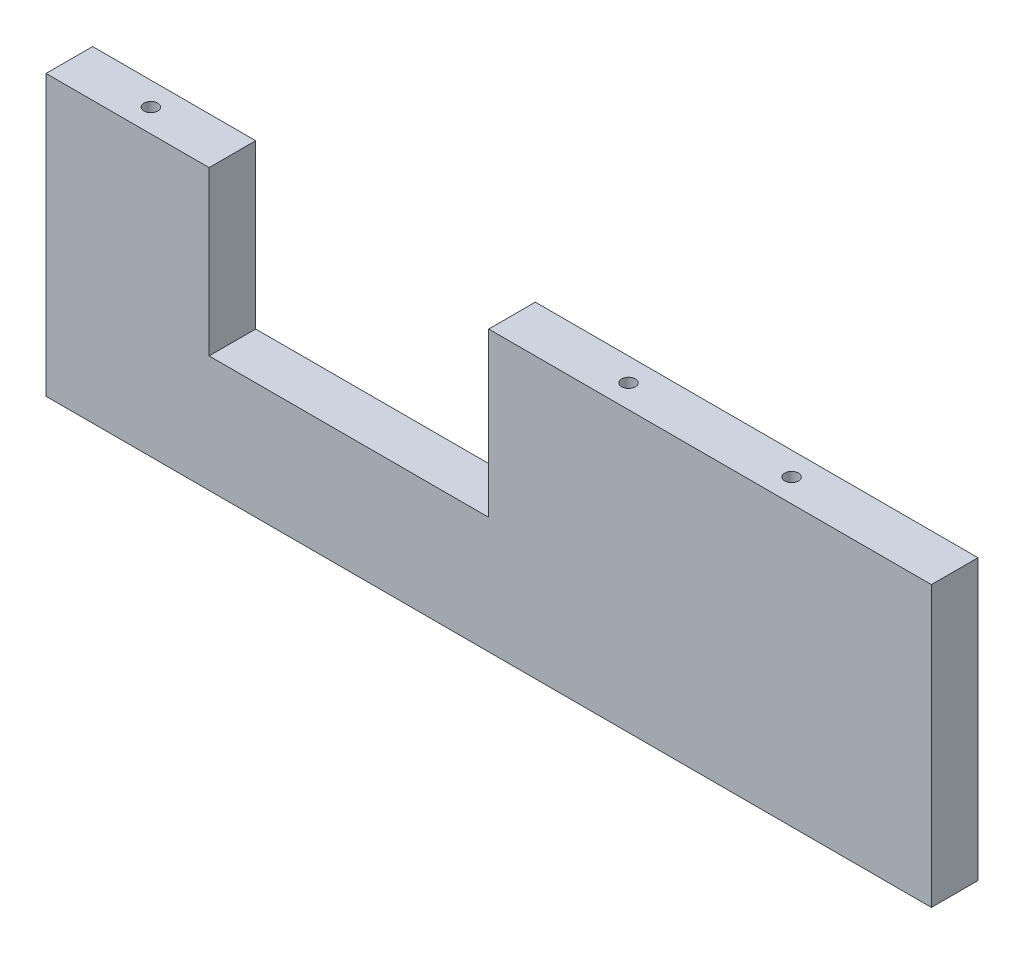
ISO-10303-21;
HEADER;
FILE_DESCRIPTION(('STEP AP214'),'2;1');
FILE_NAME('part.step','',(''),(''),'','','');
FILE_SCHEMA(('AUTOMOTIVE_DESIGN { 1 0 10303 214 1 1 1 1 }'));
ENDSEC;
DATA;
#1=APPLICATION_CONTEXT('core data for automotive mechanical design processes');
#2=APPLICATION_PROTOCOL_DEFINITION('international standard','automotive_design',2000,#1);
#3=PRODUCT_CONTEXT('',#1,'mechanical');
#4=PRODUCT('Part','Part','',(#3));
#5=PRODUCT_RELATED_PRODUCT_CATEGORY('part','',(#4));
#6=PRODUCT_DEFINITION_FORMATION('','',#4);
#7=PRODUCT_DEFINITION_CONTEXT('part definition',#1,'design');
#8=PRODUCT_DEFINITION('design','',#6,#7);
#9=PRODUCT_DEFINITION_SHAPE('','',#8);
#10=(LENGTH_UNIT() NAMED_UNIT(*) SI_UNIT(.MILLI.,.METRE.));
#11=(NAMED_UNIT(*) PLANE_ANGLE_UNIT() SI_UNIT($,.RADIAN.));
#12=(NAMED_UNIT(*) SI_UNIT($,.STERADIAN.) SOLID_ANGLE_UNIT());
#13=UNCERTAINTY_MEASURE_WITH_UNIT(LENGTH_MEASURE(1.E-05),#10,'distance_accuracy_value','');
#14=(GEOMETRIC_REPRESENTATION_CONTEXT(3) GLOBAL_UNCERTAINTY_ASSIGNED_CONTEXT((#13)) GLOBAL_UNIT_ASSIGNED_CONTEXT((#10,
#11,#12)) REPRESENTATION_CONTEXT('',''));
#15=CARTESIAN_POINT('',(0.,0.,0.));
#16=DIRECTION('',(0.,0.,1.));
#17=DIRECTION('',(1.,0.,0.));
#18=AXIS2_PLACEMENT_3D('',#15,#16,#17);
#19=CARTESIAN_POINT('',(0.,30.,10.));
#20=DIRECTION('',(0.,1.,0.));
#21=DIRECTION('',(0.,0.,1.));
#22=AXIS2_PLACEMENT_3D('',#19,#20,#21);
#23=PLANE('',#22);
#24=CARTESIAN_POINT('',(60.,30.,5.));
#25=DIRECTION('',(0.,1.,0.));
#26=DIRECTION('',(0.,0.,1.));
#27=AXIS2_PLACEMENT_3D('',#24,#25,#26);
#28=CIRCLE('',#27,1.47500000000001);
#29=CARTESIAN_POINT('',(60.,30.,6.475));
#30=VERTEX_POINT('',#29);
#31=EDGE_CURVE('E185',#30,#30,#28,.T.);
#32=ORIENTED_EDGE('',*,*,#31,.F.);
#33=EDGE_LOOP('',(#32));
#34=FACE_BOUND('',#33,.T.);
#35=CARTESIAN_POINT('',(25.,30.,5.));
#36=DIRECTION('',(0.,1.,0.));
#37=DIRECTION('',(0.,0.,1.));
#38=AXIS2_PLACEMENT_3D('',#35,#36,#37);
#39=CIRCLE('',#38,1.475);
#40=CARTESIAN_POINT('',(25.,30.,6.475));
#41=VERTEX_POINT('',#40);
#42=EDGE_CURVE('E179',#41,#41,#39,.T.);
#43=ORIENTED_EDGE('',*,*,#42,.F.);
#44=EDGE_LOOP('',(#43));
#45=FACE_BOUND('',#44,.T.);
#46=DIRECTION('',(1.,0.,0.));
#47=VECTOR('',#46,1.);
#48=CARTESIAN_POINT('',(0.,30.,0.));
#49=LINE('',#48,#47);
#50=CARTESIAN_POINT('',(0.,30.,0.));
#51=VERTEX_POINT('',#50);
#52=CARTESIAN_POINT('',(95.,30.,0.));
#53=VERTEX_POINT('',#52);
#54=EDGE_CURVE('E130',#51,#53,#49,.T.);
#55=ORIENTED_EDGE('',*,*,#54,.F.);
#56=DIRECTION('',(0.,0.,-1.));
#57=VECTOR('',#56,1.);
#58=CARTESIAN_POINT('',(0.,30.,10.));
#59=LINE('',#58,#57);
#60=CARTESIAN_POINT('',(0.,30.,10.));
#61=VERTEX_POINT('',#60);
#62=EDGE_CURVE('E11',#61,#51,#59,.T.);
#63=ORIENTED_EDGE('',*,*,#62,.F.);
#64=DIRECTION('',(1.,0.,0.));
#65=VECTOR('',#64,1.);
#66=CARTESIAN_POINT('',(0.,30.,10.));
#67=LINE('',#66,#65);
#68=CARTESIAN_POINT('',(95.,30.,10.));
#69=VERTEX_POINT('',#68);
#70=EDGE_CURVE('E149',#61,#69,#67,.T.);
#71=ORIENTED_EDGE('',*,*,#70,.T.);
#72=DIRECTION('',(0.,0.,-1.));
#73=VECTOR('',#72,1.);
#74=CARTESIAN_POINT('',(95.,30.,10.));
#75=LINE('',#74,#73);
#76=EDGE_CURVE('E52',#69,#53,#75,.T.);
#77=ORIENTED_EDGE('',*,*,#76,.T.);
#78=EDGE_LOOP('',(#55,#63,#71,#77));
#79=FACE_BOUND('',#78,.T.);
#80=ADVANCED_FACE('F35',(#34,#45,#79),#23,.T.);
#81=CARTESIAN_POINT('',(0.,0.,10.));
#82=DIRECTION('',(1.,0.,0.));
#83=DIRECTION('',(0.,1.,0.));
#84=AXIS2_PLACEMENT_3D('',#81,#82,#83);
#85=PLANE('',#84);
#86=DIRECTION('',(0.,-1.,0.));
#87=VECTOR('',#86,1.);
#88=CARTESIAN_POINT('',(0.,0.,0.));
#89=LINE('',#88,#87);
#90=CARTESIAN_POINT('',(0.,-4.99999999999999,0.));
#91=VERTEX_POINT('',#90);
#92=EDGE_CURVE('E132',#51,#91,#89,.T.);
#93=ORIENTED_EDGE('',*,*,#92,.T.);
#94=DIRECTION('',(0.,0.,-1.));
#95=VECTOR('',#94,1.);
#96=CARTESIAN_POINT('',(0.,-4.99999999999999,10.));
#97=LINE('',#96,#95);
#98=CARTESIAN_POINT('',(0.,-4.99999999999999,10.));
#99=VERTEX_POINT('',#98);
#100=EDGE_CURVE('E44',#99,#91,#97,.T.);
#101=ORIENTED_EDGE('',*,*,#100,.F.);
#102=DIRECTION('',(0.,-1.,0.));
#103=VECTOR('',#102,1.);
#104=CARTESIAN_POINT('',(0.,0.,10.));
#105=LINE('',#104,#103);
#106=EDGE_CURVE('E174',#61,#99,#105,.T.);
#107=ORIENTED_EDGE('',*,*,#106,.F.);
#108=ORIENTED_EDGE('',*,*,#62,.T.);
#109=EDGE_LOOP('',(#93,#101,#107,#108));
#110=FACE_BOUND('',#109,.T.);
#111=ADVANCED_FACE('F37',(#110),#85,.F.);
#112=CARTESIAN_POINT('',(0.,-4.99999999999999,10.));
#113=DIRECTION('',(0.,1.,0.));
#114=DIRECTION('',(0.,0.,1.));
#115=AXIS2_PLACEMENT_3D('',#112,#113,#114);
#116=PLANE('',#115);
#117=DIRECTION('',(1.,0.,0.));
#118=VECTOR('',#117,1.);
#119=CARTESIAN_POINT('',(0.,-4.99999999999999,0.));
#120=LINE('',#119,#118);
#121=CARTESIAN_POINT('',(-60.,-4.99999999999999,0.));
#122=VERTEX_POINT('',#121);
#123=EDGE_CURVE('E137',#122,#91,#120,.T.);
#124=ORIENTED_EDGE('',*,*,#123,.F.);
#125=DIRECTION('',(0.,0.,-1.));
#126=VECTOR('',#125,1.);
#127=CARTESIAN_POINT('',(-60.,-4.99999999999999,10.));
#128=LINE('',#127,#126);
#129=CARTESIAN_POINT('',(-60.,-4.99999999999999,10.));
#130=VERTEX_POINT('',#129);
#131=EDGE_CURVE('E155',#130,#122,#128,.T.);
#132=ORIENTED_EDGE('',*,*,#131,.F.);
#133=DIRECTION('',(1.,0.,0.));
#134=VECTOR('',#133,1.);
#135=CARTESIAN_POINT('',(0.,-4.99999999999999,10.));
#136=LINE('',#135,#134);
#137=EDGE_CURVE('E162',#130,#99,#136,.T.);
#138=ORIENTED_EDGE('',*,*,#137,.T.);
#139=ORIENTED_EDGE('',*,*,#100,.T.);
#140=EDGE_LOOP('',(#124,#132,#138,#139));
#141=FACE_BOUND('',#140,.T.);
#142=ADVANCED_FACE('F160',(#141),#116,.T.);
#143=CARTESIAN_POINT('',(-60.,0.,10.));
#144=DIRECTION('',(1.,0.,0.));
#145=DIRECTION('',(0.,1.,0.));
#146=AXIS2_PLACEMENT_3D('',#143,#144,#145);
#147=PLANE('',#146);
#148=DIRECTION('',(0.,-1.,0.));
#149=VECTOR('',#148,1.);
#150=CARTESIAN_POINT('',(-60.,0.,0.));
#151=LINE('',#150,#149);
#152=CARTESIAN_POINT('',(-60.,30.,0.));
#153=VERTEX_POINT('',#152);
#154=EDGE_CURVE('E140',#153,#122,#151,.T.);
#155=ORIENTED_EDGE('',*,*,#154,.F.);
#156=DIRECTION('',(0.,0.,-1.));
#157=VECTOR('',#156,1.);
#158=CARTESIAN_POINT('',(-60.,30.,10.));
#159=LINE('',#158,#157);
#160=CARTESIAN_POINT('',(-60.,30.,10.));
#161=VERTEX_POINT('',#160);
#162=EDGE_CURVE('E153',#161,#153,#159,.T.);
#163=ORIENTED_EDGE('',*,*,#162,.F.);
#164=DIRECTION('',(0.,-1.,0.));
#165=VECTOR('',#164,1.);
#166=CARTESIAN_POINT('',(-60.,0.,10.));
#167=LINE('',#166,#165);
#168=EDGE_CURVE('E173',#161,#130,#167,.T.);
#169=ORIENTED_EDGE('',*,*,#168,.T.);
#170=ORIENTED_EDGE('',*,*,#131,.T.);
#171=EDGE_LOOP('',(#155,#163,#169,#170));
#172=FACE_BOUND('',#171,.T.);
#173=ADVANCED_FACE('F171',(#172),#147,.T.);
#174=CARTESIAN_POINT('',(-77.5,30.,5.));
#175=DIRECTION('',(0.,1.,0.));
#176=DIRECTION('',(0.,0.,1.));
#177=AXIS2_PLACEMENT_3D('',#174,#175,#176);
#178=CIRCLE('',#177,1.475);
#179=CARTESIAN_POINT('',(-77.5,30.,6.475));
#180=VERTEX_POINT('',#179);
#181=EDGE_CURVE('E191',#180,#180,#178,.T.);
#182=ORIENTED_EDGE('',*,*,#181,.F.);
#183=EDGE_LOOP('',(#182));
#184=FACE_BOUND('',#183,.T.);
#185=CARTESIAN_POINT('',(-95.,30.,0.));
#186=VERTEX_POINT('',#185);
#187=EDGE_CURVE('E134',#186,#153,#49,.T.);
#188=ORIENTED_EDGE('',*,*,#187,.F.);
#189=DIRECTION('',(0.,0.,-1.));
#190=VECTOR('',#189,1.);
#191=CARTESIAN_POINT('',(-95.,30.,10.));
#192=LINE('',#191,#190);
#193=CARTESIAN_POINT('',(-95.,30.,10.));
#194=VERTEX_POINT('',#193);
#195=EDGE_CURVE('E122',#194,#186,#192,.T.);
#196=ORIENTED_EDGE('',*,*,#195,.F.);
#197=EDGE_CURVE('E112',#194,#161,#67,.T.);
#198=ORIENTED_EDGE('',*,*,#197,.T.);
#199=ORIENTED_EDGE('',*,*,#162,.T.);
#200=EDGE_LOOP('',(#188,#196,#198,#199));
#201=FACE_BOUND('',#200,.T.);
#202=ADVANCED_FACE('F206',(#184,#201),#23,.T.);
#203=CARTESIAN_POINT('',(-95.,0.,10.));
#204=DIRECTION('',(1.,0.,0.));
#205=DIRECTION('',(0.,1.,0.));
#206=AXIS2_PLACEMENT_3D('',#203,#204,#205);
#207=PLANE('',#206);
#208=DIRECTION('',(0.,-1.,0.));
#209=VECTOR('',#208,1.);
#210=CARTESIAN_POINT('',(-95.,0.,0.));
#211=LINE('',#210,#209);
#212=CARTESIAN_POINT('',(-95.,-30.,0.));
#213=VERTEX_POINT('',#212);
#214=EDGE_CURVE('E119',#186,#213,#211,.T.);
#215=ORIENTED_EDGE('',*,*,#214,.T.);
#216=DIRECTION('',(0.,0.,-1.));
#217=VECTOR('',#216,1.);
#218=CARTESIAN_POINT('',(-95.,-30.,10.));
#219=LINE('',#218,#217);
#220=CARTESIAN_POINT('',(-95.,-30.,10.));
#221=VERTEX_POINT('',#220);
#222=EDGE_CURVE('E116',#221,#213,#219,.T.);
#223=ORIENTED_EDGE('',*,*,#222,.F.);
#224=DIRECTION('',(0.,-1.,0.));
#225=VECTOR('',#224,1.);
#226=CARTESIAN_POINT('',(-95.,0.,10.));
#227=LINE('',#226,#225);
#228=EDGE_CURVE('E103',#194,#221,#227,.T.);
#229=ORIENTED_EDGE('',*,*,#228,.F.);
#230=ORIENTED_EDGE('',*,*,#195,.T.);
#231=EDGE_LOOP('',(#215,#223,#229,#230));
#232=FACE_BOUND('',#231,.T.);
#233=ADVANCED_FACE('F117',(#232),#207,.F.);
#234=CARTESIAN_POINT('',(0.,-30.,10.));
#235=DIRECTION('',(0.,1.,0.));
#236=DIRECTION('',(0.,0.,1.));
#237=AXIS2_PLACEMENT_3D('',#234,#235,#236);
#238=PLANE('',#237);
#239=CARTESIAN_POINT('',(-77.5,-30.,5.));
#240=DIRECTION('',(0.,1.,0.));
#241=DIRECTION('',(0.,0.,1.));
#242=AXIS2_PLACEMENT_3D('',#239,#240,#241);
#243=CIRCLE('',#242,1.475);
#244=CARTESIAN_POINT('',(-77.5,-30.,6.475));
#245=VERTEX_POINT('',#244);
#246=EDGE_CURVE('E133',#245,#245,#243,.T.);
#247=ORIENTED_EDGE('',*,*,#246,.T.);
#248=EDGE_LOOP('',(#247));
#249=FACE_BOUND('',#248,.T.);
#250=CARTESIAN_POINT('',(60.,-30.,5.));
#251=DIRECTION('',(0.,1.,0.));
#252=DIRECTION('',(0.,0.,1.));
#253=AXIS2_PLACEMENT_3D('',#250,#251,#252);
#254=CIRCLE('',#253,1.47500000000001);
#255=CARTESIAN_POINT('',(60.,-30.,6.475));
#256=VERTEX_POINT('',#255);
#257=EDGE_CURVE('E188',#256,#256,#254,.T.);
#258=ORIENTED_EDGE('',*,*,#257,.T.);
#259=EDGE_LOOP('',(#258));
#260=FACE_BOUND('',#259,.T.);
#261=CARTESIAN_POINT('',(25.,-30.,5.));
#262=DIRECTION('',(0.,1.,0.));
#263=DIRECTION('',(0.,0.,1.));
#264=AXIS2_PLACEMENT_3D('',#261,#262,#263);
#265=CIRCLE('',#264,1.475);
#266=CARTESIAN_POINT('',(25.,-30.,6.475));
#267=VERTEX_POINT('',#266);
#268=EDGE_CURVE('E182',#267,#267,#265,.T.);
#269=ORIENTED_EDGE('',*,*,#268,.T.);
#270=EDGE_LOOP('',(#269));
#271=FACE_BOUND('',#270,.T.);
#272=DIRECTION('',(1.,0.,0.));
#273=VECTOR('',#272,1.);
#274=CARTESIAN_POINT('',(0.,-30.,0.));
#275=LINE('',#274,#273);
#276=CARTESIAN_POINT('',(95.,-30.,0.));
#277=VERTEX_POINT('',#276);
#278=EDGE_CURVE('E144',#213,#277,#275,.T.);
#279=ORIENTED_EDGE('',*,*,#278,.T.);
#280=DIRECTION('',(0.,0.,-1.));
#281=VECTOR('',#280,1.);
#282=CARTESIAN_POINT('',(95.,-30.,10.));
#283=LINE('',#282,#281);
#284=CARTESIAN_POINT('',(95.,-30.,10.));
#285=VERTEX_POINT('',#284);
#286=EDGE_CURVE('E78',#285,#277,#283,.T.);
#287=ORIENTED_EDGE('',*,*,#286,.F.);
#288=DIRECTION('',(1.,0.,0.));
#289=VECTOR('',#288,1.);
#290=CARTESIAN_POINT('',(0.,-30.,10.));
#291=LINE('',#290,#289);
#292=EDGE_CURVE('E109',#221,#285,#291,.T.);
#293=ORIENTED_EDGE('',*,*,#292,.F.);
#294=ORIENTED_EDGE('',*,*,#222,.T.);
#295=EDGE_LOOP('',(#279,#287,#293,#294));
#296=FACE_BOUND('',#295,.T.);
#297=ADVANCED_FACE('F124',(#249,#260,#271,#296),#238,.F.);
#298=CARTESIAN_POINT('',(95.,0.,10.));
#299=DIRECTION('',(1.,0.,0.));
#300=DIRECTION('',(0.,1.,0.));
#301=AXIS2_PLACEMENT_3D('',#298,#299,#300);
#302=PLANE('',#301);
#303=DIRECTION('',(0.,-1.,0.));
#304=VECTOR('',#303,1.);
#305=CARTESIAN_POINT('',(95.,0.,0.));
#306=LINE('',#305,#304);
#307=EDGE_CURVE('E146',#53,#277,#306,.T.);
#308=ORIENTED_EDGE('',*,*,#307,.F.);
#309=ORIENTED_EDGE('',*,*,#76,.F.);
#310=DIRECTION('',(0.,-1.,0.));
#311=VECTOR('',#310,1.);
#312=CARTESIAN_POINT('',(95.,0.,10.));
#313=LINE('',#312,#311);
#314=EDGE_CURVE('E125',#69,#285,#313,.T.);
#315=ORIENTED_EDGE('',*,*,#314,.T.);
#316=ORIENTED_EDGE('',*,*,#286,.T.);
#317=EDGE_LOOP('',(#308,#309,#315,#316));
#318=FACE_BOUND('',#317,.T.);
#319=ADVANCED_FACE('F210',(#318),#302,.T.);
#320=CARTESIAN_POINT('',(0.,0.,10.));
#321=DIRECTION('',(0.,0.,1.));
#322=DIRECTION('',(1.,0.,0.));
#323=AXIS2_PLACEMENT_3D('',#320,#321,#322);
#324=PLANE('',#323);
#325=ORIENTED_EDGE('',*,*,#70,.F.);
#326=ORIENTED_EDGE('',*,*,#106,.T.);
#327=ORIENTED_EDGE('',*,*,#137,.F.);
#328=ORIENTED_EDGE('',*,*,#168,.F.);
#329=ORIENTED_EDGE('',*,*,#197,.F.);
#330=ORIENTED_EDGE('',*,*,#228,.T.);
#331=ORIENTED_EDGE('',*,*,#292,.T.);
#332=ORIENTED_EDGE('',*,*,#314,.F.);
#333=EDGE_LOOP('',(#325,#326,#327,#328,#329,#330,#331,#332));
#334=FACE_BOUND('',#333,.T.);
#335=ADVANCED_FACE('F106',(#334),#324,.T.);
#336=CARTESIAN_POINT('',(0.,0.,0.));
#337=DIRECTION('',(0.,0.,1.));
#338=DIRECTION('',(1.,0.,0.));
#339=AXIS2_PLACEMENT_3D('',#336,#337,#338);
#340=PLANE('',#339);
#341=ORIENTED_EDGE('',*,*,#54,.T.);
#342=ORIENTED_EDGE('',*,*,#307,.T.);
#343=ORIENTED_EDGE('',*,*,#278,.F.);
#344=ORIENTED_EDGE('',*,*,#214,.F.);
#345=ORIENTED_EDGE('',*,*,#187,.T.);
#346=ORIENTED_EDGE('',*,*,#154,.T.);
#347=ORIENTED_EDGE('',*,*,#123,.T.);
#348=ORIENTED_EDGE('',*,*,#92,.F.);
#349=EDGE_LOOP('',(#341,#342,#343,#344,#345,#346,#347,#348));
#350=FACE_BOUND('',#349,.T.);
#351=ADVANCED_FACE('F166',(#350),#340,.F.);
#352=CARTESIAN_POINT('',(25.,-30.,5.));
#353=DIRECTION('',(0.,1.,0.));
#354=DIRECTION('',(0.,0.,1.));
#355=AXIS2_PLACEMENT_3D('',#352,#353,#354);
#356=CYLINDRICAL_SURFACE('',#355,1.475);
#357=ORIENTED_EDGE('',*,*,#268,.F.);
#358=EDGE_LOOP('',(#357));
#359=FACE_BOUND('',#358,.T.);
#360=ORIENTED_EDGE('',*,*,#42,.T.);
#361=EDGE_LOOP('',(#360));
#362=FACE_BOUND('',#361,.T.);
#363=ADVANCED_FACE('F258',(#359,#362),#356,.F.);
#364=CARTESIAN_POINT('',(60.,-30.,5.));
#365=DIRECTION('',(0.,1.,0.));
#366=DIRECTION('',(0.,0.,1.));
#367=AXIS2_PLACEMENT_3D('',#364,#365,#366);
#368=CYLINDRICAL_SURFACE('',#367,1.47500000000001);
#369=ORIENTED_EDGE('',*,*,#257,.F.);
#370=EDGE_LOOP('',(#369));
#371=FACE_BOUND('',#370,.T.);
#372=ORIENTED_EDGE('',*,*,#31,.T.);
#373=EDGE_LOOP('',(#372));
#374=FACE_BOUND('',#373,.T.);
#375=ADVANCED_FACE('F202',(#371,#374),#368,.F.);
#376=CARTESIAN_POINT('',(-77.5,-30.,5.));
#377=DIRECTION('',(0.,1.,0.));
#378=DIRECTION('',(0.,0.,1.));
#379=AXIS2_PLACEMENT_3D('',#376,#377,#378);
#380=CYLINDRICAL_SURFACE('',#379,1.475);
#381=ORIENTED_EDGE('',*,*,#246,.F.);
#382=EDGE_LOOP('',(#381));
#383=FACE_BOUND('',#382,.T.);
#384=ORIENTED_EDGE('',*,*,#181,.T.);
#385=EDGE_LOOP('',(#384));
#386=FACE_BOUND('',#385,.T.);
#387=ADVANCED_FACE('F199',(#383,#386),#380,.F.);
#388=CLOSED_SHELL('',(#80,#111,#142,#173,#202,#233,#297,#319,#335,#351,#363,#375,#387));
#389=MANIFOLD_SOLID_BREP('B2',#388);
#390=ADVANCED_BREP_SHAPE_REPRESENTATION('',(#18,#389),#14);
#391=SHAPE_DEFINITION_REPRESENTATION(#9,#390);
ENDSEC;
END-ISO-10303-21;
